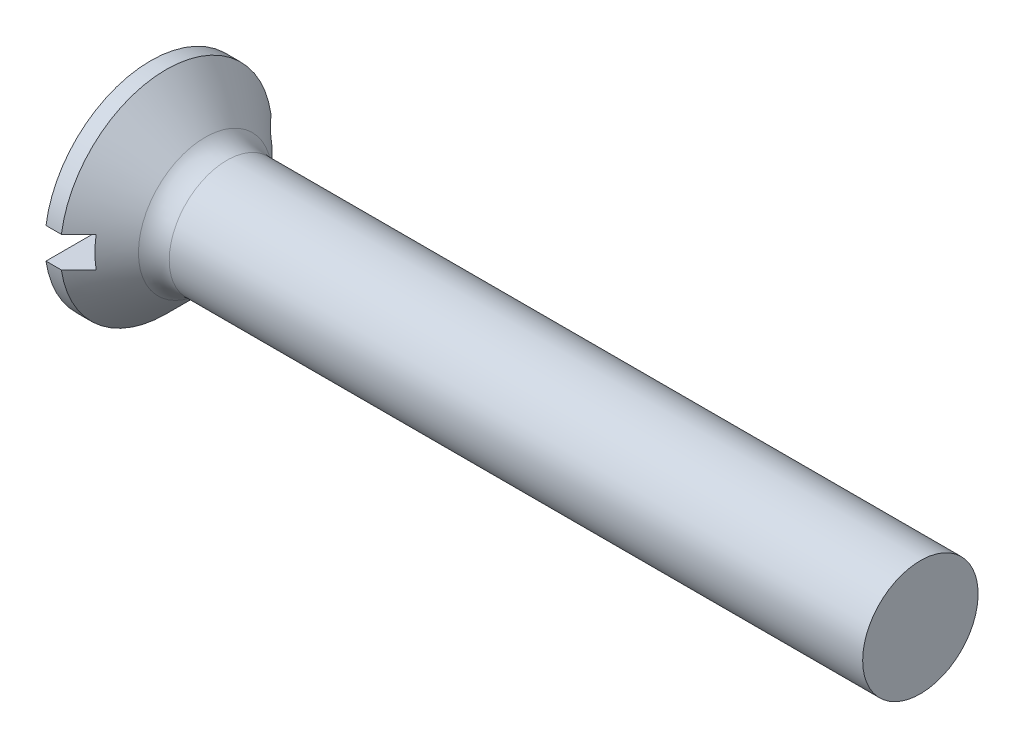
ISO-10303-21;
HEADER;
FILE_DESCRIPTION(('STEP AP214'),'2;1');
FILE_NAME('part.step','',(''),(''),'','','');
FILE_SCHEMA(('AUTOMOTIVE_DESIGN { 1 0 10303 214 1 1 1 1 }'));
ENDSEC;
DATA;
#1=APPLICATION_CONTEXT('core data for automotive mechanical design processes');
#2=APPLICATION_PROTOCOL_DEFINITION('international standard','automotive_design',2000,#1);
#3=PRODUCT_CONTEXT('',#1,'mechanical');
#4=PRODUCT('Part','Part','',(#3));
#5=PRODUCT_RELATED_PRODUCT_CATEGORY('part','',(#4));
#6=PRODUCT_DEFINITION_FORMATION('','',#4);
#7=PRODUCT_DEFINITION_CONTEXT('part definition',#1,'design');
#8=PRODUCT_DEFINITION('design','',#6,#7);
#9=PRODUCT_DEFINITION_SHAPE('','',#8);
#10=(LENGTH_UNIT() NAMED_UNIT(*) SI_UNIT(.MILLI.,.METRE.));
#11=(NAMED_UNIT(*) PLANE_ANGLE_UNIT() SI_UNIT($,.RADIAN.));
#12=(NAMED_UNIT(*) SI_UNIT($,.STERADIAN.) SOLID_ANGLE_UNIT());
#13=UNCERTAINTY_MEASURE_WITH_UNIT(LENGTH_MEASURE(1.E-05),#10,'distance_accuracy_value','');
#14=(GEOMETRIC_REPRESENTATION_CONTEXT(3) GLOBAL_UNCERTAINTY_ASSIGNED_CONTEXT((#13)) GLOBAL_UNIT_ASSIGNED_CONTEXT((#10,
#11,#12)) REPRESENTATION_CONTEXT('',''));
#15=CARTESIAN_POINT('',(0.,0.,0.));
#16=DIRECTION('',(0.,0.,1.));
#17=DIRECTION('',(1.,0.,0.));
#18=AXIS2_PLACEMENT_3D('',#15,#16,#17);
#19=CARTESIAN_POINT('',(0.85,-0.4,-2.75));
#20=DIRECTION('',(1.,0.,0.));
#21=DIRECTION('',(0.,0.,-1.));
#22=AXIS2_PLACEMENT_3D('',#19,#20,#21);
#23=PLANE('',#22);
#24=CARTESIAN_POINT('',(0.850000000045665,0.,0.));
#25=DIRECTION('',(-1.,0.,0.));
#26=DIRECTION('',(0.,0.,1.));
#27=AXIS2_PLACEMENT_3D('',#24,#25,#26);
#28=CIRCLE('',#27,2.29999999999109);
#29=CARTESIAN_POINT('',(0.850000000034848,0.4,2.26495033058316));
#30=VERTEX_POINT('',#29);
#31=CARTESIAN_POINT('',(0.850000000022832,-0.400000000000001,2.26495033059536));
#32=VERTEX_POINT('',#31);
#33=EDGE_CURVE('E80',#30,#32,#28,.F.);
#34=ORIENTED_EDGE('',*,*,#33,.F.);
#35=DIRECTION('',(0.,0.,1.));
#36=VECTOR('',#35,1.);
#37=CARTESIAN_POINT('',(0.85,0.4,2.75));
#38=LINE('',#37,#36);
#39=CARTESIAN_POINT('',(0.850000000022832,0.4,-2.26495033059536));
#40=VERTEX_POINT('',#39);
#41=EDGE_CURVE('E82',#30,#40,#38,.F.);
#42=ORIENTED_EDGE('',*,*,#41,.T.);
#43=CARTESIAN_POINT('',(0.850000000045665,0.,0.));
#44=DIRECTION('',(-1.,0.,0.));
#45=DIRECTION('',(0.,0.,1.));
#46=AXIS2_PLACEMENT_3D('',#43,#44,#45);
#47=CIRCLE('',#46,2.29999999999109);
#48=CARTESIAN_POINT('',(0.850000000034848,-0.400000000000001,-2.26495033058316));
#49=VERTEX_POINT('',#48);
#50=EDGE_CURVE('E20',#49,#40,#47,.F.);
#51=ORIENTED_EDGE('',*,*,#50,.F.);
#52=DIRECTION('',(0.,0.,-1.));
#53=VECTOR('',#52,1.);
#54=CARTESIAN_POINT('',(0.85,-0.4,-2.75));
#55=LINE('',#54,#53);
#56=EDGE_CURVE('E130',#49,#32,#55,.F.);
#57=ORIENTED_EDGE('',*,*,#56,.T.);
#58=EDGE_LOOP('',(#34,#42,#51,#57));
#59=FACE_BOUND('',#58,.T.);
#60=ADVANCED_FACE('F17',(#59),#23,.F.);
#61=CARTESIAN_POINT('',(0.85,-0.4,-2.75));
#62=DIRECTION('',(0.,-1.,0.));
#63=DIRECTION('',(0.,0.,-1.));
#64=AXIS2_PLACEMENT_3D('',#61,#62,#63);
#65=PLANE('',#64);
#66=CARTESIAN_POINT('',(0.85000000002447,-0.400000000000001,2.2649503305937));
#67=CARTESIAN_POINT('',(0.775087851769284,-0.400000000000001,2.34100427520676));
#68=CARTESIAN_POINT('',(0.700131776523775,-0.400000000000001,2.41701485210356));
#69=CARTESIAN_POINT('',(0.550131776521701,-0.400000000000001,2.56894926593744));
#70=CARTESIAN_POINT('',(0.475087851770372,-0.400000000000001,2.64487310287968));
#71=CARTESIAN_POINT('',(0.400000000033955,-0.400000000000001,2.72075357211084));
#72=B_SPLINE_CURVE_WITH_KNOTS('',3,(#66,#67,#68,#69,#70,#71),.UNSPECIFIED.,.F.,.F.,(4,2,4),(0.,
0.320256442788528,0.64051286649153),.UNSPECIFIED.);
#73=CARTESIAN_POINT('',(0.400000000023617,-0.400000000000001,2.7207535720967));
#74=VERTEX_POINT('',#73);
#75=EDGE_CURVE('E120',#32,#74,#72,.T.);
#76=ORIENTED_EDGE('',*,*,#75,.F.);
#77=ORIENTED_EDGE('',*,*,#56,.F.);
#78=CARTESIAN_POINT('',(0.400000000033956,-0.4,-2.72075357211084));
#79=CARTESIAN_POINT('',(0.475087851770298,-0.4,-2.64487310287976));
#80=CARTESIAN_POINT('',(0.550131776521554,-0.4,-2.56894926593759));
#81=CARTESIAN_POINT('',(0.700131776523482,-0.4,-2.41701485210386));
#82=CARTESIAN_POINT('',(0.775087851768917,-0.4,-2.34100427520713));
#83=CARTESIAN_POINT('',(0.850000000024031,-0.4,-2.26495033059414));
#84=B_SPLINE_CURVE_WITH_KNOTS('',3,(#78,#79,#80,#81,#82,#83),.UNSPECIFIED.,.F.,.F.,(4,2,4),(0.,
0.320256423702688,0.640512866490903),.UNSPECIFIED.);
#85=CARTESIAN_POINT('',(0.400000000037608,-0.400000000000001,-2.72075357207842));
#86=VERTEX_POINT('',#85);
#87=EDGE_CURVE('E76',#86,#49,#84,.T.);
#88=ORIENTED_EDGE('',*,*,#87,.F.);
#89=DIRECTION('',(1.,0.,0.));
#90=VECTOR('',#89,1.);
#91=CARTESIAN_POINT('',(0.85,-0.4,-2.72075357208256));
#92=LINE('',#91,#90);
#93=CARTESIAN_POINT('',(0.,-0.400000000000001,-2.72075357208256));
#94=VERTEX_POINT('',#93);
#95=EDGE_CURVE('E131',#94,#86,#92,.T.);
#96=ORIENTED_EDGE('',*,*,#95,.F.);
#97=DIRECTION('',(0.,0.,1.));
#98=VECTOR('',#97,1.);
#99=CARTESIAN_POINT('',(0.,-0.400000000000001,0.));
#100=LINE('',#99,#98);
#101=CARTESIAN_POINT('',(0.,-0.400000000000001,2.72075357208256));
#102=VERTEX_POINT('',#101);
#103=EDGE_CURVE('E90',#102,#94,#100,.F.);
#104=ORIENTED_EDGE('',*,*,#103,.F.);
#105=DIRECTION('',(1.,0.,0.));
#106=VECTOR('',#105,1.);
#107=CARTESIAN_POINT('',(0.85,-0.400000000000001,2.72075357208256));
#108=LINE('',#107,#106);
#109=EDGE_CURVE('E166',#74,#102,#108,.F.);
#110=ORIENTED_EDGE('',*,*,#109,.F.);
#111=EDGE_LOOP('',(#76,#77,#88,#96,#104,#110));
#112=FACE_BOUND('',#111,.T.);
#113=ADVANCED_FACE('F132',(#112),#65,.F.);
#114=CARTESIAN_POINT('',(0.85,0.4,2.75));
#115=DIRECTION('',(0.,1.,0.));
#116=DIRECTION('',(0.,0.,1.));
#117=AXIS2_PLACEMENT_3D('',#114,#115,#116);
#118=PLANE('',#117);
#119=CARTESIAN_POINT('',(0.850000000024469,0.4,-2.2649503305937));
#120=CARTESIAN_POINT('',(0.775087851769283,0.4,-2.34100427520676));
#121=CARTESIAN_POINT('',(0.700131776523775,0.4,-2.41701485210356));
#122=CARTESIAN_POINT('',(0.550131776521701,0.4,-2.56894926593744));
#123=CARTESIAN_POINT('',(0.475087851770372,0.4,-2.64487310287968));
#124=CARTESIAN_POINT('',(0.400000000033955,0.4,-2.72075357211084));
#125=B_SPLINE_CURVE_WITH_KNOTS('',3,(#119,#120,#121,#122,#123,#124),.UNSPECIFIED.,.F.,.F.,(4,2,
4),(0.,0.320256442788528,0.640512866491529),.UNSPECIFIED.);
#126=CARTESIAN_POINT('',(0.400000000023617,0.4,-2.7207535720967));
#127=VERTEX_POINT('',#126);
#128=EDGE_CURVE('E72',#40,#127,#125,.T.);
#129=ORIENTED_EDGE('',*,*,#128,.F.);
#130=ORIENTED_EDGE('',*,*,#41,.F.);
#131=CARTESIAN_POINT('',(0.400000000033956,0.4,2.72075357211084));
#132=CARTESIAN_POINT('',(0.475087851770298,0.4,2.64487310287976));
#133=CARTESIAN_POINT('',(0.550131776521554,0.4,2.56894926593759));
#134=CARTESIAN_POINT('',(0.700131776523482,0.4,2.41701485210386));
#135=CARTESIAN_POINT('',(0.775087851768917,0.4,2.34100427520713));
#136=CARTESIAN_POINT('',(0.850000000024031,0.4,2.26495033059414));
#137=B_SPLINE_CURVE_WITH_KNOTS('',3,(#131,#132,#133,#134,#135,#136),.UNSPECIFIED.,.F.,.F.,(4,2,
4),(0.,0.320256423702688,0.640512866490903),.UNSPECIFIED.);
#138=CARTESIAN_POINT('',(0.400000000037608,0.4,2.72075357207842));
#139=VERTEX_POINT('',#138);
#140=EDGE_CURVE('E84',#139,#30,#137,.T.);
#141=ORIENTED_EDGE('',*,*,#140,.F.);
#142=DIRECTION('',(1.,0.,0.));
#143=VECTOR('',#142,1.);
#144=CARTESIAN_POINT('',(0.85,0.4,2.72075357208256));
#145=LINE('',#144,#143);
#146=CARTESIAN_POINT('',(0.,0.4,2.72075357208256));
#147=VERTEX_POINT('',#146);
#148=EDGE_CURVE('E35',#147,#139,#145,.T.);
#149=ORIENTED_EDGE('',*,*,#148,.F.);
#150=DIRECTION('',(0.,0.,1.));
#151=VECTOR('',#150,1.);
#152=CARTESIAN_POINT('',(0.,0.4,0.));
#153=LINE('',#152,#151);
#154=CARTESIAN_POINT('',(0.,0.4,-2.72075357208256));
#155=VERTEX_POINT('',#154);
#156=EDGE_CURVE('E161',#155,#147,#153,.T.);
#157=ORIENTED_EDGE('',*,*,#156,.F.);
#158=DIRECTION('',(1.,0.,0.));
#159=VECTOR('',#158,1.);
#160=CARTESIAN_POINT('',(0.85,0.4,-2.72075357208256));
#161=LINE('',#160,#159);
#162=EDGE_CURVE('E88',#127,#155,#161,.F.);
#163=ORIENTED_EDGE('',*,*,#162,.F.);
#164=EDGE_LOOP('',(#129,#130,#141,#149,#157,#163));
#165=FACE_BOUND('',#164,.T.);
#166=ADVANCED_FACE('F87',(#165),#118,.F.);
#167=CARTESIAN_POINT('',(0.,0.,0.));
#168=DIRECTION('',(-1.,0.,0.));
#169=DIRECTION('',(0.,0.,1.));
#170=AXIS2_PLACEMENT_3D('',#167,#168,#169);
#171=PLANE('',#170);
#172=ORIENTED_EDGE('',*,*,#103,.T.);
#173=CARTESIAN_POINT('',(0.,0.,0.));
#174=DIRECTION('',(-1.,0.,0.));
#175=DIRECTION('',(0.,0.,1.));
#176=AXIS2_PLACEMENT_3D('',#173,#174,#175);
#177=CIRCLE('',#176,2.75);
#178=EDGE_CURVE('E100',#102,#94,#177,.F.);
#179=ORIENTED_EDGE('',*,*,#178,.F.);
#180=EDGE_LOOP('',(#172,#179));
#181=FACE_BOUND('',#180,.T.);
#182=ADVANCED_FACE('F142',(#181),#171,.T.);
#183=CARTESIAN_POINT('',(0.,0.,0.));
#184=DIRECTION('',(-1.,0.,0.));
#185=DIRECTION('',(0.,0.,1.));
#186=AXIS2_PLACEMENT_3D('',#183,#184,#185);
#187=PLANE('',#186);
#188=ORIENTED_EDGE('',*,*,#156,.T.);
#189=CARTESIAN_POINT('',(0.,0.,0.));
#190=DIRECTION('',(-1.,0.,0.));
#191=DIRECTION('',(0.,0.,1.));
#192=AXIS2_PLACEMENT_3D('',#189,#190,#191);
#193=CIRCLE('',#192,2.75);
#194=EDGE_CURVE('E172',#155,#147,#193,.F.);
#195=ORIENTED_EDGE('',*,*,#194,.F.);
#196=EDGE_LOOP('',(#188,#195));
#197=FACE_BOUND('',#196,.T.);
#198=ADVANCED_FACE('F187',(#197),#187,.T.);
#199=CARTESIAN_POINT('',(-6.34999999999999,0.,0.));
#200=DIRECTION('',(-1.,0.,0.));
#201=DIRECTION('',(0.,0.,1.));
#202=AXIS2_PLACEMENT_3D('',#199,#200,#201);
#203=CYLINDRICAL_SURFACE('',#202,2.75);
#204=ORIENTED_EDGE('',*,*,#95,.T.);
#205=CARTESIAN_POINT('',(0.400000000013279,0.,0.));
#206=DIRECTION('',(-1.,0.,0.));
#207=DIRECTION('',(0.,0.,1.));
#208=AXIS2_PLACEMENT_3D('',#205,#206,#207);
#209=CIRCLE('',#208,2.74999999999181);
#210=EDGE_CURVE('E169',#74,#86,#209,.F.);
#211=ORIENTED_EDGE('',*,*,#210,.F.);
#212=ORIENTED_EDGE('',*,*,#109,.T.);
#213=ORIENTED_EDGE('',*,*,#178,.T.);
#214=EDGE_LOOP('',(#204,#211,#212,#213));
#215=FACE_BOUND('',#214,.T.);
#216=ADVANCED_FACE('F181',(#215),#203,.T.);
#217=CARTESIAN_POINT('',(-6.34999999999999,0.,0.));
#218=DIRECTION('',(-1.,0.,0.));
#219=DIRECTION('',(0.,0.,1.));
#220=AXIS2_PLACEMENT_3D('',#217,#218,#219);
#221=CYLINDRICAL_SURFACE('',#220,2.75);
#222=ORIENTED_EDGE('',*,*,#148,.T.);
#223=CARTESIAN_POINT('',(0.400000000013279,0.,0.));
#224=DIRECTION('',(-1.,0.,0.));
#225=DIRECTION('',(0.,0.,1.));
#226=AXIS2_PLACEMENT_3D('',#223,#224,#225);
#227=CIRCLE('',#226,2.74999999999181);
#228=EDGE_CURVE('E160',#127,#139,#227,.F.);
#229=ORIENTED_EDGE('',*,*,#228,.F.);
#230=ORIENTED_EDGE('',*,*,#162,.T.);
#231=ORIENTED_EDGE('',*,*,#194,.T.);
#232=EDGE_LOOP('',(#222,#229,#230,#231));
#233=FACE_BOUND('',#232,.T.);
#234=ADVANCED_FACE('F114',(#233),#221,.T.);
#235=CARTESIAN_POINT('',(0.399999999956435,0.,0.));
#236=DIRECTION('',(-1.,0.,0.));
#237=DIRECTION('',(0.,0.,1.));
#238=AXIS2_PLACEMENT_3D('',#235,#236,#237);
#239=CONICAL_SURFACE('',#238,2.7500000001055,0.785398163425431);
#240=ORIENTED_EDGE('',*,*,#87,.T.);
#241=ORIENTED_EDGE('',*,*,#50,.T.);
#242=ORIENTED_EDGE('',*,*,#128,.T.);
#243=ORIENTED_EDGE('',*,*,#228,.T.);
#244=ORIENTED_EDGE('',*,*,#140,.T.);
#245=ORIENTED_EDGE('',*,*,#33,.T.);
#246=ORIENTED_EDGE('',*,*,#75,.T.);
#247=ORIENTED_EDGE('',*,*,#210,.T.);
#248=EDGE_LOOP('',(#240,#241,#242,#243,#244,#245,#246,#247));
#249=FACE_BOUND('',#248,.T.);
#250=CARTESIAN_POINT('',(1.41568542494924,0.,0.));
#251=DIRECTION('',(-1.,0.,0.));
#252=DIRECTION('',(0.,0.,1.));
#253=AXIS2_PLACEMENT_3D('',#250,#251,#252);
#254=CIRCLE('',#253,1.73431457505076);
#255=CARTESIAN_POINT('',(1.41568542494924,0.,1.73431457505076));
#256=VERTEX_POINT('',#255);
#257=EDGE_CURVE('E157',#256,#256,#254,.T.);
#258=ORIENTED_EDGE('',*,*,#257,.T.);
#259=EDGE_LOOP('',(#258));
#260=FACE_BOUND('',#259,.T.);
#261=ADVANCED_FACE('F68',(#249,#260),#239,.T.);
#262=CARTESIAN_POINT('',(20.,1.5,0.));
#263=DIRECTION('',(1.,0.,0.));
#264=DIRECTION('',(0.,0.,-1.));
#265=AXIS2_PLACEMENT_3D('',#262,#263,#264);
#266=PLANE('',#265);
#267=CARTESIAN_POINT('',(20.,0.,0.));
#268=DIRECTION('',(-1.,0.,0.));
#269=DIRECTION('',(0.,0.,1.));
#270=AXIS2_PLACEMENT_3D('',#267,#268,#269);
#271=CIRCLE('',#270,1.5);
#272=CARTESIAN_POINT('',(20.,0.,1.5));
#273=VERTEX_POINT('',#272);
#274=EDGE_CURVE('E26',#273,#273,#271,.T.);
#275=ORIENTED_EDGE('',*,*,#274,.F.);
#276=EDGE_LOOP('',(#275));
#277=FACE_BOUND('',#276,.T.);
#278=ADVANCED_FACE('F113',(#277),#266,.T.);
#279=CARTESIAN_POINT('',(1.98137084989848,0.,0.));
#280=DIRECTION('',(-1.,0.,0.));
#281=DIRECTION('',(0.,0.,1.));
#282=AXIS2_PLACEMENT_3D('',#279,#280,#281);
#283=TOROIDAL_SURFACE('',#282,2.3,0.8);
#284=ORIENTED_EDGE('',*,*,#257,.F.);
#285=EDGE_LOOP('',(#284));
#286=FACE_BOUND('',#285,.T.);
#287=CARTESIAN_POINT('',(1.98137084989848,0.,0.));
#288=DIRECTION('',(-1.,0.,0.));
#289=DIRECTION('',(0.,0.,1.));
#290=AXIS2_PLACEMENT_3D('',#287,#288,#289);
#291=CIRCLE('',#290,1.5);
#292=CARTESIAN_POINT('',(1.98137084989848,0.,1.5));
#293=VERTEX_POINT('',#292);
#294=EDGE_CURVE('E11',#293,#293,#291,.F.);
#295=ORIENTED_EDGE('',*,*,#294,.F.);
#296=EDGE_LOOP('',(#295));
#297=FACE_BOUND('',#296,.T.);
#298=ADVANCED_FACE('F146',(#286,#297),#283,.F.);
#299=CARTESIAN_POINT('',(-6.34999999999999,0.,0.));
#300=DIRECTION('',(-1.,0.,0.));
#301=DIRECTION('',(0.,0.,1.));
#302=AXIS2_PLACEMENT_3D('',#299,#300,#301);
#303=CYLINDRICAL_SURFACE('',#302,1.5);
#304=ORIENTED_EDGE('',*,*,#294,.T.);
#305=EDGE_LOOP('',(#304));
#306=FACE_BOUND('',#305,.T.);
#307=ORIENTED_EDGE('',*,*,#274,.T.);
#308=EDGE_LOOP('',(#307));
#309=FACE_BOUND('',#308,.T.);
#310=ADVANCED_FACE('F144',(#306,#309),#303,.T.);
#311=CLOSED_SHELL('',(#60,#113,#166,#182,#198,#216,#234,#261,#278,#298,#310));
#312=MANIFOLD_SOLID_BREP('B1',#311);
#313=ADVANCED_BREP_SHAPE_REPRESENTATION('',(#18,#312),#14);
#314=SHAPE_DEFINITION_REPRESENTATION(#9,#313);
ENDSEC;
END-ISO-10303-21;
